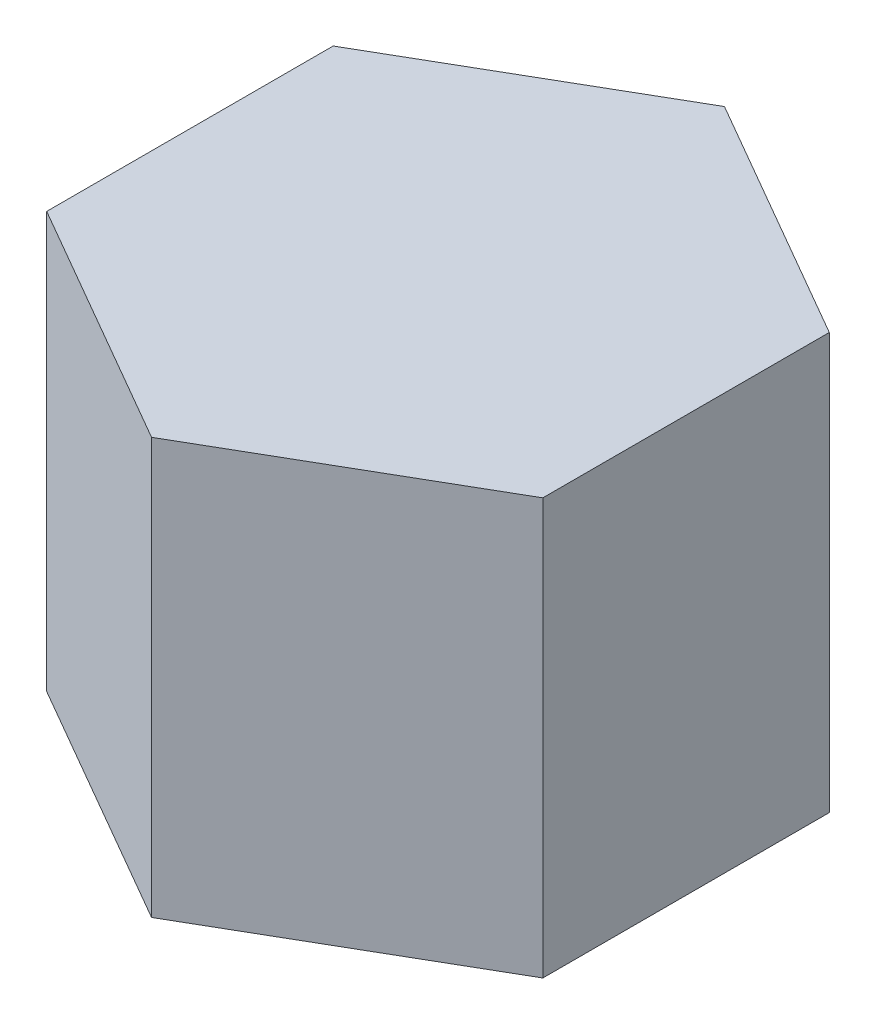
ISO-10303-21;
HEADER;
FILE_DESCRIPTION(('STEP AP214'),'2;1');
FILE_NAME('part.step','',(''),(''),'','','');
FILE_SCHEMA(('AUTOMOTIVE_DESIGN { 1 0 10303 214 1 1 1 1 }'));
ENDSEC;
DATA;
#1=APPLICATION_CONTEXT('core data for automotive mechanical design processes');
#2=APPLICATION_PROTOCOL_DEFINITION('international standard','automotive_design',2000,#1);
#3=PRODUCT_CONTEXT('',#1,'mechanical');
#4=PRODUCT('Part','Part','',(#3));
#5=PRODUCT_RELATED_PRODUCT_CATEGORY('part','',(#4));
#6=PRODUCT_DEFINITION_FORMATION('','',#4);
#7=PRODUCT_DEFINITION_CONTEXT('part definition',#1,'design');
#8=PRODUCT_DEFINITION('design','',#6,#7);
#9=PRODUCT_DEFINITION_SHAPE('','',#8);
#10=(LENGTH_UNIT() NAMED_UNIT(*) SI_UNIT(.MILLI.,.METRE.));
#11=(NAMED_UNIT(*) PLANE_ANGLE_UNIT() SI_UNIT($,.RADIAN.));
#12=(NAMED_UNIT(*) SI_UNIT($,.STERADIAN.) SOLID_ANGLE_UNIT());
#13=UNCERTAINTY_MEASURE_WITH_UNIT(LENGTH_MEASURE(1.E-05),#10,'distance_accuracy_value','');
#14=(GEOMETRIC_REPRESENTATION_CONTEXT(3) GLOBAL_UNCERTAINTY_ASSIGNED_CONTEXT((#13)) GLOBAL_UNIT_ASSIGNED_CONTEXT((#10,
#11,#12)) REPRESENTATION_CONTEXT('',''));
#15=CARTESIAN_POINT('',(0.,0.,0.));
#16=DIRECTION('',(0.,0.,1.));
#17=DIRECTION('',(1.,0.,0.));
#18=AXIS2_PLACEMENT_3D('',#15,#16,#17);
#19=CARTESIAN_POINT('',(202.142660308706,-148.537700895744,290.64094581671));
#20=DIRECTION('',(-0.499999999999909,0.,-0.866025403784491));
#21=DIRECTION('',(-0.866025403784491,0.,0.499999999999909));
#22=AXIS2_PLACEMENT_3D('',#19,#20,#21);
#23=PLANE('',#22);
#24=CARTESIAN_POINT('',(201.839551417382,-149.045793579175,290.81594581671));
#25=DIRECTION('',(0.866025403784491,0.,-0.499999999999909));
#26=VECTOR('',#25,1.);
#27=LINE('',#24,#26);
#28=CARTESIAN_POINT('',(201.839551417382,-149.045793579175,290.81594581671));
#29=VERTEX_POINT('',#28);
#30=CARTESIAN_POINT('',(202.142660308706,-149.045793579175,290.64094581671));
#31=VERTEX_POINT('',#30);
#32=EDGE_CURVE('E170',#29,#31,#27,.T.);
#33=ORIENTED_EDGE('',*,*,#32,.T.);
#34=CARTESIAN_POINT('',(202.142660308706,-148.537700895744,290.64094581671));
#35=DIRECTION('',(0.,-1.,0.));
#36=VECTOR('',#35,1.);
#37=LINE('',#34,#36);
#38=CARTESIAN_POINT('',(202.142660308706,-148.537700895744,290.64094581671));
#39=VERTEX_POINT('',#38);
#40=EDGE_CURVE('E35',#39,#31,#37,.T.);
#41=ORIENTED_EDGE('',*,*,#40,.F.);
#42=CARTESIAN_POINT('',(201.839551417382,-148.537700895744,290.81594581671));
#43=DIRECTION('',(0.866025403784491,0.,-0.499999999999909));
#44=VECTOR('',#43,1.);
#45=LINE('',#42,#44);
#46=CARTESIAN_POINT('',(201.839551417382,-148.537700895744,290.81594581671));
#47=VERTEX_POINT('',#46);
#48=EDGE_CURVE('E159',#47,#39,#45,.T.);
#49=ORIENTED_EDGE('',*,*,#48,.F.);
#50=CARTESIAN_POINT('',(201.839551417382,-148.537700895744,290.81594581671));
#51=DIRECTION('',(0.,-1.,0.));
#52=VECTOR('',#51,1.);
#53=LINE('',#50,#52);
#54=EDGE_CURVE('E10',#47,#29,#53,.T.);
#55=ORIENTED_EDGE('',*,*,#54,.T.);
#56=EDGE_LOOP('',(#33,#41,#49,#55));
#57=FACE_BOUND('',#56,.T.);
#58=ADVANCED_FACE('F16',(#57),#23,.F.);
#59=CARTESIAN_POINT('',(201.839551417382,-148.537700895744,290.81594581671));
#60=DIRECTION('',(0.499999999999978,0.,-0.866025403784452));
#61=DIRECTION('',(-0.866025403784452,0.,-0.499999999999978));
#62=AXIS2_PLACEMENT_3D('',#59,#60,#61);
#63=PLANE('',#62);
#64=CARTESIAN_POINT('',(201.536442526057,-149.045793579175,290.64094581671));
#65=DIRECTION('',(0.866025403784452,0.,0.499999999999978));
#66=VECTOR('',#65,1.);
#67=LINE('',#64,#66);
#68=CARTESIAN_POINT('',(201.536442526057,-149.045793579175,290.64094581671));
#69=VERTEX_POINT('',#68);
#70=EDGE_CURVE('E167',#69,#29,#67,.T.);
#71=ORIENTED_EDGE('',*,*,#70,.T.);
#72=ORIENTED_EDGE('',*,*,#54,.F.);
#73=CARTESIAN_POINT('',(201.536442526057,-148.537700895744,290.64094581671));
#74=DIRECTION('',(0.866025403784452,0.,0.499999999999978));
#75=VECTOR('',#74,1.);
#76=LINE('',#73,#75);
#77=CARTESIAN_POINT('',(201.536442526057,-148.537700895744,290.64094581671));
#78=VERTEX_POINT('',#77);
#79=EDGE_CURVE('E156',#78,#47,#76,.T.);
#80=ORIENTED_EDGE('',*,*,#79,.F.);
#81=CARTESIAN_POINT('',(201.536442526057,-148.537700895744,290.64094581671));
#82=DIRECTION('',(0.,-1.,0.));
#83=VECTOR('',#82,1.);
#84=LINE('',#81,#83);
#85=EDGE_CURVE('E27',#78,#69,#84,.T.);
#86=ORIENTED_EDGE('',*,*,#85,.T.);
#87=EDGE_LOOP('',(#71,#72,#80,#86));
#88=FACE_BOUND('',#87,.T.);
#89=ADVANCED_FACE('F189',(#88),#63,.F.);
#90=CARTESIAN_POINT('',(201.536442526057,-148.537700895744,290.831971220494));
#91=DIRECTION('',(1.,0.,0.));
#92=DIRECTION('',(0.,1.,0.));
#93=AXIS2_PLACEMENT_3D('',#90,#91,#92);
#94=PLANE('',#93);
#95=CARTESIAN_POINT('',(201.536442526057,-149.045793579175,290.29094581671));
#96=DIRECTION('',(0.,0.,1.));
#97=VECTOR('',#96,1.);
#98=LINE('',#95,#97);
#99=CARTESIAN_POINT('',(201.536442526057,-149.045793579175,290.29094581671));
#100=VERTEX_POINT('',#99);
#101=EDGE_CURVE('E163',#100,#69,#98,.T.);
#102=ORIENTED_EDGE('',*,*,#101,.T.);
#103=ORIENTED_EDGE('',*,*,#85,.F.);
#104=CARTESIAN_POINT('',(201.536442526057,-148.537700895744,290.29094581671));
#105=DIRECTION('',(0.,0.,1.));
#106=VECTOR('',#105,1.);
#107=LINE('',#104,#106);
#108=CARTESIAN_POINT('',(201.536442526057,-148.537700895744,290.29094581671));
#109=VERTEX_POINT('',#108);
#110=EDGE_CURVE('E106',#109,#78,#107,.T.);
#111=ORIENTED_EDGE('',*,*,#110,.F.);
#112=CARTESIAN_POINT('',(201.536442526057,-148.537700895744,290.29094581671));
#113=DIRECTION('',(0.,-1.,0.));
#114=VECTOR('',#113,1.);
#115=LINE('',#112,#114);
#116=EDGE_CURVE('E94',#109,#100,#115,.T.);
#117=ORIENTED_EDGE('',*,*,#116,.T.);
#118=EDGE_LOOP('',(#102,#103,#111,#117));
#119=FACE_BOUND('',#118,.T.);
#120=ADVANCED_FACE('F198',(#119),#94,.F.);
#121=CARTESIAN_POINT('',(201.536442526057,-148.537700895744,290.29094581671));
#122=DIRECTION('',(0.499999999999943,0.,0.866025403784472));
#123=DIRECTION('',(0.866025403784472,0.,-0.499999999999943));
#124=AXIS2_PLACEMENT_3D('',#121,#122,#123);
#125=PLANE('',#124);
#126=CARTESIAN_POINT('',(201.839551417382,-149.045793579175,290.11594581671));
#127=DIRECTION('',(-0.866025403784471,0.,0.499999999999943));
#128=VECTOR('',#127,1.);
#129=LINE('',#126,#128);
#130=CARTESIAN_POINT('',(201.839551417382,-149.045793579175,290.11594581671));
#131=VERTEX_POINT('',#130);
#132=EDGE_CURVE('E162',#131,#100,#129,.T.);
#133=ORIENTED_EDGE('',*,*,#132,.T.);
#134=ORIENTED_EDGE('',*,*,#116,.F.);
#135=CARTESIAN_POINT('',(201.839551417382,-148.537700895744,290.11594581671));
#136=DIRECTION('',(-0.866025403784471,0.,0.499999999999943));
#137=VECTOR('',#136,1.);
#138=LINE('',#135,#137);
#139=CARTESIAN_POINT('',(201.839551417382,-148.537700895744,290.11594581671));
#140=VERTEX_POINT('',#139);
#141=EDGE_CURVE('E98',#140,#109,#138,.T.);
#142=ORIENTED_EDGE('',*,*,#141,.F.);
#143=CARTESIAN_POINT('',(201.839551417382,-148.537700895744,290.11594581671));
#144=DIRECTION('',(0.,-1.,0.));
#145=VECTOR('',#144,1.);
#146=LINE('',#143,#145);
#147=EDGE_CURVE('E79',#140,#131,#146,.T.);
#148=ORIENTED_EDGE('',*,*,#147,.T.);
#149=EDGE_LOOP('',(#133,#134,#142,#148));
#150=FACE_BOUND('',#149,.T.);
#151=ADVANCED_FACE('F100',(#150),#125,.F.);
#152=CARTESIAN_POINT('',(201.839551417382,-148.537700895744,290.11594581671));
#153=DIRECTION('',(-0.499999999999943,0.,0.866025403784472));
#154=DIRECTION('',(0.866025403784472,0.,0.499999999999943));
#155=AXIS2_PLACEMENT_3D('',#152,#153,#154);
#156=PLANE('',#155);
#157=CARTESIAN_POINT('',(202.142660308706,-149.045793579175,290.29094581671));
#158=DIRECTION('',(-0.866025403784471,0.,-0.499999999999943));
#159=VECTOR('',#158,1.);
#160=LINE('',#157,#159);
#161=CARTESIAN_POINT('',(202.142660308706,-149.045793579175,290.29094581671));
#162=VERTEX_POINT('',#161);
#163=EDGE_CURVE('E88',#162,#131,#160,.T.);
#164=ORIENTED_EDGE('',*,*,#163,.T.);
#165=ORIENTED_EDGE('',*,*,#147,.F.);
#166=CARTESIAN_POINT('',(202.142660308706,-148.537700895744,290.29094581671));
#167=DIRECTION('',(-0.866025403784471,0.,-0.499999999999943));
#168=VECTOR('',#167,1.);
#169=LINE('',#166,#168);
#170=CARTESIAN_POINT('',(202.142660308706,-148.537700895744,290.29094581671));
#171=VERTEX_POINT('',#170);
#172=EDGE_CURVE('E84',#171,#140,#169,.T.);
#173=ORIENTED_EDGE('',*,*,#172,.F.);
#174=CARTESIAN_POINT('',(202.142660308706,-148.537700895744,290.29094581671));
#175=DIRECTION('',(0.,-1.,0.));
#176=VECTOR('',#175,1.);
#177=LINE('',#174,#176);
#178=EDGE_CURVE('E58',#171,#162,#177,.T.);
#179=ORIENTED_EDGE('',*,*,#178,.T.);
#180=EDGE_LOOP('',(#164,#165,#173,#179));
#181=FACE_BOUND('',#180,.T.);
#182=ADVANCED_FACE('F82',(#181),#156,.F.);
#183=CARTESIAN_POINT('',(202.142660308706,-148.537700895744,290.831971220494));
#184=DIRECTION('',(-1.,0.,0.));
#185=DIRECTION('',(0.,-1.,0.));
#186=AXIS2_PLACEMENT_3D('',#183,#184,#185);
#187=PLANE('',#186);
#188=CARTESIAN_POINT('',(202.142660308706,-149.045793579175,290.64094581671));
#189=DIRECTION('',(0.,0.,-1.));
#190=VECTOR('',#189,1.);
#191=LINE('',#188,#190);
#192=EDGE_CURVE('E160',#31,#162,#191,.T.);
#193=ORIENTED_EDGE('',*,*,#192,.T.);
#194=ORIENTED_EDGE('',*,*,#178,.F.);
#195=CARTESIAN_POINT('',(202.142660308706,-148.537700895744,290.64094581671));
#196=DIRECTION('',(0.,0.,-1.));
#197=VECTOR('',#196,1.);
#198=LINE('',#195,#197);
#199=EDGE_CURVE('E112',#39,#171,#198,.T.);
#200=ORIENTED_EDGE('',*,*,#199,.F.);
#201=ORIENTED_EDGE('',*,*,#40,.T.);
#202=EDGE_LOOP('',(#193,#194,#200,#201));
#203=FACE_BOUND('',#202,.T.);
#204=ADVANCED_FACE('F131',(#203),#187,.F.);
#205=CARTESIAN_POINT('',(206.339551417382,-148.537700895744,290.831971220494));
#206=DIRECTION('',(0.,-1.,0.));
#207=DIRECTION('',(1.,0.,0.));
#208=AXIS2_PLACEMENT_3D('',#205,#206,#207);
#209=PLANE('',#208);
#210=ORIENTED_EDGE('',*,*,#48,.T.);
#211=ORIENTED_EDGE('',*,*,#199,.T.);
#212=ORIENTED_EDGE('',*,*,#172,.T.);
#213=ORIENTED_EDGE('',*,*,#141,.T.);
#214=ORIENTED_EDGE('',*,*,#110,.T.);
#215=ORIENTED_EDGE('',*,*,#79,.T.);
#216=EDGE_LOOP('',(#210,#211,#212,#213,#214,#215));
#217=FACE_BOUND('',#216,.T.);
#218=ADVANCED_FACE('F111',(#217),#209,.F.);
#219=CARTESIAN_POINT('',(206.339551417382,-149.045793579175,290.831971220494));
#220=DIRECTION('',(0.,-1.,0.));
#221=DIRECTION('',(1.,0.,0.));
#222=AXIS2_PLACEMENT_3D('',#219,#220,#221);
#223=PLANE('',#222);
#224=ORIENTED_EDGE('',*,*,#32,.F.);
#225=ORIENTED_EDGE('',*,*,#70,.F.);
#226=ORIENTED_EDGE('',*,*,#101,.F.);
#227=ORIENTED_EDGE('',*,*,#132,.F.);
#228=ORIENTED_EDGE('',*,*,#163,.F.);
#229=ORIENTED_EDGE('',*,*,#192,.F.);
#230=EDGE_LOOP('',(#224,#225,#226,#227,#228,#229));
#231=FACE_BOUND('',#230,.T.);
#232=ADVANCED_FACE('F130',(#231),#223,.T.);
#233=CLOSED_SHELL('',(#58,#89,#120,#151,#182,#204,#218,#232));
#234=MANIFOLD_SOLID_BREP('B1',#233);
#235=ADVANCED_BREP_SHAPE_REPRESENTATION('',(#18,#234),#14);
#236=SHAPE_DEFINITION_REPRESENTATION(#9,#235);
ENDSEC;
END-ISO-10303-21;
